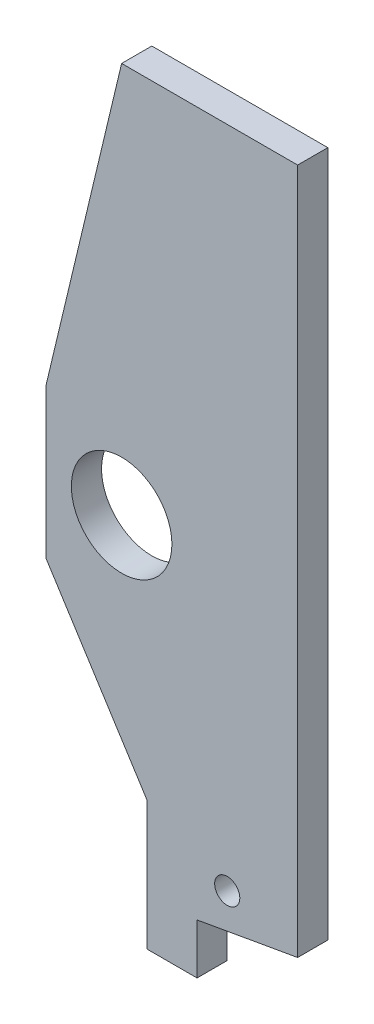
ISO-10303-21;
HEADER;
FILE_DESCRIPTION(('STEP AP214'),'2;1');
FILE_NAME('part.step','',(''),(''),'','','');
FILE_SCHEMA(('AUTOMOTIVE_DESIGN { 1 0 10303 214 1 1 1 1 }'));
ENDSEC;
DATA;
#1=APPLICATION_CONTEXT('core data for automotive mechanical design processes');
#2=APPLICATION_PROTOCOL_DEFINITION('international standard','automotive_design',2000,#1);
#3=PRODUCT_CONTEXT('',#1,'mechanical');
#4=PRODUCT('Part','Part','',(#3));
#5=PRODUCT_RELATED_PRODUCT_CATEGORY('part','',(#4));
#6=PRODUCT_DEFINITION_FORMATION('','',#4);
#7=PRODUCT_DEFINITION_CONTEXT('part definition',#1,'design');
#8=PRODUCT_DEFINITION('design','',#6,#7);
#9=PRODUCT_DEFINITION_SHAPE('','',#8);
#10=(LENGTH_UNIT() NAMED_UNIT(*) SI_UNIT(.MILLI.,.METRE.));
#11=(NAMED_UNIT(*) PLANE_ANGLE_UNIT() SI_UNIT($,.RADIAN.));
#12=(NAMED_UNIT(*) SI_UNIT($,.STERADIAN.) SOLID_ANGLE_UNIT());
#13=UNCERTAINTY_MEASURE_WITH_UNIT(LENGTH_MEASURE(1.E-05),#10,'distance_accuracy_value','');
#14=(GEOMETRIC_REPRESENTATION_CONTEXT(3) GLOBAL_UNCERTAINTY_ASSIGNED_CONTEXT((#13)) GLOBAL_UNIT_ASSIGNED_CONTEXT((#10,
#11,#12)) REPRESENTATION_CONTEXT('',''));
#15=CARTESIAN_POINT('',(0.,0.,0.));
#16=DIRECTION('',(0.,0.,1.));
#17=DIRECTION('',(1.,0.,0.));
#18=AXIS2_PLACEMENT_3D('',#15,#16,#17);
#19=CARTESIAN_POINT('',(-25.315931780366,-34.9461314475873,3.));
#20=DIRECTION('',(-1.,0.,0.));
#21=DIRECTION('',(0.,0.,1.));
#22=AXIS2_PLACEMENT_3D('',#19,#20,#21);
#23=PLANE('',#22);
#24=DIRECTION('',(0.,1.,0.));
#25=VECTOR('',#24,1.);
#26=CARTESIAN_POINT('',(-25.315931780366,-34.9461314475873,3.));
#27=LINE('',#26,#25);
#28=CARTESIAN_POINT('',(-25.315931780366,-33.1823790005765,3.));
#29=VERTEX_POINT('',#28);
#30=CARTESIAN_POINT('',(-25.315931780366,35.0538685524127,3.));
#31=VERTEX_POINT('',#30);
#32=EDGE_CURVE('E51',#29,#31,#27,.T.);
#33=ORIENTED_EDGE('',*,*,#32,.F.);
#34=DIRECTION('',(0.,0.,1.));
#35=VECTOR('',#34,1.);
#36=CARTESIAN_POINT('',(-25.315931780366,-33.1823790005765,-5.00000000001367E-05));
#37=LINE('',#36,#35);
#38=CARTESIAN_POINT('',(-25.315931780366,-33.1823790005765,0.));
#39=VERTEX_POINT('',#38);
#40=EDGE_CURVE('E102',#39,#29,#37,.T.);
#41=ORIENTED_EDGE('',*,*,#40,.F.);
#42=DIRECTION('',(0.,1.,0.));
#43=VECTOR('',#42,1.);
#44=CARTESIAN_POINT('',(-25.315931780366,-34.9461314475873,0.));
#45=LINE('',#44,#43);
#46=CARTESIAN_POINT('',(-25.315931780366,35.0538685524127,0.));
#47=VERTEX_POINT('',#46);
#48=EDGE_CURVE('E121',#39,#47,#45,.T.);
#49=ORIENTED_EDGE('',*,*,#48,.T.);
#50=DIRECTION('',(0.,0.,-1.));
#51=VECTOR('',#50,1.);
#52=CARTESIAN_POINT('',(-25.315931780366,35.0538685524127,3.));
#53=LINE('',#52,#51);
#54=EDGE_CURVE('E44',#31,#47,#53,.T.);
#55=ORIENTED_EDGE('',*,*,#54,.F.);
#56=EDGE_LOOP('',(#33,#41,#49,#55));
#57=FACE_BOUND('',#56,.T.);
#58=ADVANCED_FACE('F35',(#57),#23,.F.);
#59=CARTESIAN_POINT('',(-35.315931780366,35.0538685524127,3.));
#60=DIRECTION('',(0.,-1.,0.));
#61=DIRECTION('',(0.,0.,-1.));
#62=AXIS2_PLACEMENT_3D('',#59,#60,#61);
#63=PLANE('',#62);
#64=DIRECTION('',(-1.,0.,0.));
#65=VECTOR('',#64,1.);
#66=CARTESIAN_POINT('',(-35.315931780366,35.0538685524127,0.));
#67=LINE('',#66,#65);
#68=CARTESIAN_POINT('',(-42.815931780366,35.0538685524127,0.));
#69=VERTEX_POINT('',#68);
#70=EDGE_CURVE('E118',#47,#69,#67,.T.);
#71=ORIENTED_EDGE('',*,*,#70,.T.);
#72=DIRECTION('',(0.,0.,1.));
#73=VECTOR('',#72,1.);
#74=CARTESIAN_POINT('',(-42.815931780366,35.0538685524127,0.));
#75=LINE('',#74,#73);
#76=CARTESIAN_POINT('',(-42.815931780366,35.0538685524127,3.));
#77=VERTEX_POINT('',#76);
#78=EDGE_CURVE('E183',#69,#77,#75,.T.);
#79=ORIENTED_EDGE('',*,*,#78,.T.);
#80=DIRECTION('',(-1.,0.,0.));
#81=VECTOR('',#80,1.);
#82=CARTESIAN_POINT('',(-35.315931780366,35.0538685524127,3.));
#83=LINE('',#82,#81);
#84=EDGE_CURVE('E117',#31,#77,#83,.T.);
#85=ORIENTED_EDGE('',*,*,#84,.F.);
#86=ORIENTED_EDGE('',*,*,#54,.T.);
#87=EDGE_LOOP('',(#71,#79,#85,#86));
#88=FACE_BOUND('',#87,.T.);
#89=ADVANCED_FACE('F226',(#88),#63,.F.);
#90=CARTESIAN_POINT('',(0.,0.,3.));
#91=DIRECTION('',(0.,0.,-1.));
#92=DIRECTION('',(-1.,0.,0.));
#93=AXIS2_PLACEMENT_3D('',#90,#91,#92);
#94=PLANE('',#93);
#95=CARTESIAN_POINT('',(-32.315931780366,-30.9461314475873,3.));
#96=DIRECTION('',(0.,0.,1.));
#97=DIRECTION('',(1.,0.,0.));
#98=AXIS2_PLACEMENT_3D('',#95,#96,#97);
#99=CIRCLE('',#98,1.25);
#100=CARTESIAN_POINT('',(-31.065931780366,-30.9461314475873,3.));
#101=VERTEX_POINT('',#100);
#102=EDGE_CURVE('E140',#101,#101,#99,.T.);
#103=ORIENTED_EDGE('',*,*,#102,.F.);
#104=EDGE_LOOP('',(#103));
#105=FACE_BOUND('',#104,.T.);
#106=CARTESIAN_POINT('',(-42.815931780366,-3.84613144758735,3.));
#107=DIRECTION('',(0.,0.,1.));
#108=DIRECTION('',(1.,0.,0.));
#109=AXIS2_PLACEMENT_3D('',#106,#107,#108);
#110=CIRCLE('',#109,5.);
#111=CARTESIAN_POINT('',(-37.815931780366,-3.84613144758735,3.));
#112=VERTEX_POINT('',#111);
#113=EDGE_CURVE('E137',#112,#112,#110,.T.);
#114=ORIENTED_EDGE('',*,*,#113,.F.);
#115=EDGE_LOOP('',(#114));
#116=FACE_BOUND('',#115,.T.);
#117=DIRECTION('',(0.,-1.,0.));
#118=VECTOR('',#117,1.);
#119=CARTESIAN_POINT('',(-35.3159317803662,-1.47032102244952E-13,3.));
#120=LINE('',#119,#118);
#121=CARTESIAN_POINT('',(-35.315931780366,-34.9461314475873,3.));
#122=VERTEX_POINT('',#121);
#123=CARTESIAN_POINT('',(-35.315931780366,-39.9461314475873,3.));
#124=VERTEX_POINT('',#123);
#125=EDGE_CURVE('E114',#122,#124,#120,.T.);
#126=ORIENTED_EDGE('',*,*,#125,.F.);
#127=DIRECTION('',(-0.984799623762772,-0.173694274622694,0.));
#128=VECTOR('',#127,1.);
#129=CARTESIAN_POINT('',(-35.315931780366,-34.9461314475873,3.));
#130=LINE('',#129,#128);
#131=EDGE_CURVE('E104',#29,#122,#130,.T.);
#132=ORIENTED_EDGE('',*,*,#131,.F.);
#133=ORIENTED_EDGE('',*,*,#32,.T.);
#134=ORIENTED_EDGE('',*,*,#84,.T.);
#135=DIRECTION('',(-0.232318420027201,-0.972639785180549,0.));
#136=VECTOR('',#135,1.);
#137=CARTESIAN_POINT('',(-48.4259238946689,11.566701567198,3.));
#138=LINE('',#137,#136);
#139=CARTESIAN_POINT('',(-50.315931780366,3.65386855241265,3.));
#140=VERTEX_POINT('',#139);
#141=EDGE_CURVE('E175',#77,#140,#138,.T.);
#142=ORIENTED_EDGE('',*,*,#141,.T.);
#143=DIRECTION('',(0.,-1.,0.));
#144=VECTOR('',#143,1.);
#145=CARTESIAN_POINT('',(-50.315931780366,0.,3.));
#146=LINE('',#145,#144);
#147=CARTESIAN_POINT('',(-50.315931780366,-11.3461314475873,3.));
#148=VERTEX_POINT('',#147);
#149=EDGE_CURVE('E192',#140,#148,#146,.T.);
#150=ORIENTED_EDGE('',*,*,#149,.T.);
#151=DIRECTION('',(0.536412624057495,-0.84395586185046,0.));
#152=VECTOR('',#151,1.);
#153=CARTESIAN_POINT('',(-40.9745919188176,-26.0431728297569,3.));
#154=LINE('',#153,#152);
#155=CARTESIAN_POINT('',(-40.315931780366,-27.0794647809207,3.));
#156=VERTEX_POINT('',#155);
#157=EDGE_CURVE('E156',#148,#156,#154,.T.);
#158=ORIENTED_EDGE('',*,*,#157,.T.);
#159=DIRECTION('',(0.,1.,0.));
#160=VECTOR('',#159,1.);
#161=CARTESIAN_POINT('',(-40.315931780366,0.,3.));
#162=LINE('',#161,#160);
#163=CARTESIAN_POINT('',(-40.315931780366,-39.9461314475873,3.));
#164=VERTEX_POINT('',#163);
#165=EDGE_CURVE('E136',#164,#156,#162,.T.);
#166=ORIENTED_EDGE('',*,*,#165,.F.);
#167=DIRECTION('',(-1.,0.,0.));
#168=VECTOR('',#167,1.);
#169=CARTESIAN_POINT('',(0.,-39.9461314475873,3.));
#170=LINE('',#169,#168);
#171=EDGE_CURVE('E171',#124,#164,#170,.T.);
#172=ORIENTED_EDGE('',*,*,#171,.F.);
#173=EDGE_LOOP('',(#126,#132,#133,#134,#142,#150,#158,#166,#172));
#174=FACE_BOUND('',#173,.T.);
#175=ADVANCED_FACE('F112',(#105,#116,#174),#94,.F.);
#176=CARTESIAN_POINT('',(0.,0.,0.));
#177=DIRECTION('',(0.,0.,-1.));
#178=DIRECTION('',(-1.,0.,0.));
#179=AXIS2_PLACEMENT_3D('',#176,#177,#178);
#180=PLANE('',#179);
#181=DIRECTION('',(0.984799623762771,0.173694274622694,0.));
#182=VECTOR('',#181,1.);
#183=CARTESIAN_POINT('',(4.91220643239281,-27.850883726443,0.));
#184=LINE('',#183,#182);
#185=CARTESIAN_POINT('',(-35.315931780366,-34.9461314475873,-2.25000000000684E-05));
#186=VERTEX_POINT('',#185);
#187=EDGE_CURVE('E107',#186,#39,#184,.T.);
#188=ORIENTED_EDGE('',*,*,#187,.F.);
#189=DIRECTION('',(0.,-1.,0.));
#190=VECTOR('',#189,1.);
#191=CARTESIAN_POINT('',(-35.3159317803662,-1.47032102244952E-13,0.));
#192=LINE('',#191,#190);
#193=CARTESIAN_POINT('',(-35.315931780366,-39.9461314475873,0.));
#194=VERTEX_POINT('',#193);
#195=EDGE_CURVE('E124',#186,#194,#192,.T.);
#196=ORIENTED_EDGE('',*,*,#195,.T.);
#197=DIRECTION('',(-1.,0.,0.));
#198=VECTOR('',#197,1.);
#199=CARTESIAN_POINT('',(0.,-39.9461314475873,0.));
#200=LINE('',#199,#198);
#201=CARTESIAN_POINT('',(-40.315931780366,-39.9461314475873,0.));
#202=VERTEX_POINT('',#201);
#203=EDGE_CURVE('E155',#194,#202,#200,.T.);
#204=ORIENTED_EDGE('',*,*,#203,.T.);
#205=DIRECTION('',(0.,1.,0.));
#206=VECTOR('',#205,1.);
#207=CARTESIAN_POINT('',(-40.315931780366,0.,0.));
#208=LINE('',#207,#206);
#209=CARTESIAN_POINT('',(-40.315931780366,-27.0794647809207,0.));
#210=VERTEX_POINT('',#209);
#211=EDGE_CURVE('E153',#202,#210,#208,.T.);
#212=ORIENTED_EDGE('',*,*,#211,.T.);
#213=DIRECTION('',(0.536412624057495,-0.84395586185046,0.));
#214=VECTOR('',#213,1.);
#215=CARTESIAN_POINT('',(-40.9745919188176,-26.0431728297569,0.));
#216=LINE('',#215,#214);
#217=CARTESIAN_POINT('',(-50.315931780366,-11.3461314475873,0.));
#218=VERTEX_POINT('',#217);
#219=EDGE_CURVE('E165',#218,#210,#216,.T.);
#220=ORIENTED_EDGE('',*,*,#219,.F.);
#221=DIRECTION('',(0.,-1.,0.));
#222=VECTOR('',#221,1.);
#223=CARTESIAN_POINT('',(-50.315931780366,0.,0.));
#224=LINE('',#223,#222);
#225=CARTESIAN_POINT('',(-50.315931780366,3.65386855241265,0.));
#226=VERTEX_POINT('',#225);
#227=EDGE_CURVE('E162',#226,#218,#224,.T.);
#228=ORIENTED_EDGE('',*,*,#227,.F.);
#229=DIRECTION('',(-0.232318420027201,-0.972639785180549,0.));
#230=VECTOR('',#229,1.);
#231=CARTESIAN_POINT('',(-48.4259238946689,11.566701567198,0.));
#232=LINE('',#231,#230);
#233=EDGE_CURVE('E159',#69,#226,#232,.T.);
#234=ORIENTED_EDGE('',*,*,#233,.F.);
#235=ORIENTED_EDGE('',*,*,#70,.F.);
#236=ORIENTED_EDGE('',*,*,#48,.F.);
#237=EDGE_LOOP('',(#188,#196,#204,#212,#220,#228,#234,#235,#236));
#238=FACE_BOUND('',#237,.T.);
#239=CARTESIAN_POINT('',(-32.315931780366,-30.9461314475873,0.));
#240=DIRECTION('',(0.,0.,-1.));
#241=DIRECTION('',(-1.,0.,0.));
#242=AXIS2_PLACEMENT_3D('',#239,#240,#241);
#243=CIRCLE('',#242,1.25);
#244=CARTESIAN_POINT('',(-33.565931780366,-30.9461314475873,0.));
#245=VERTEX_POINT('',#244);
#246=EDGE_CURVE('E138',#245,#245,#243,.T.);
#247=ORIENTED_EDGE('',*,*,#246,.F.);
#248=EDGE_LOOP('',(#247));
#249=FACE_BOUND('',#248,.T.);
#250=CARTESIAN_POINT('',(-42.815931780366,-3.84613144758735,0.));
#251=DIRECTION('',(0.,0.,-1.));
#252=DIRECTION('',(-1.,0.,0.));
#253=AXIS2_PLACEMENT_3D('',#250,#251,#252);
#254=CIRCLE('',#253,5.);
#255=CARTESIAN_POINT('',(-47.815931780366,-3.84613144758735,0.));
#256=VERTEX_POINT('',#255);
#257=EDGE_CURVE('E133',#256,#256,#254,.T.);
#258=ORIENTED_EDGE('',*,*,#257,.F.);
#259=EDGE_LOOP('',(#258));
#260=FACE_BOUND('',#259,.T.);
#261=ADVANCED_FACE('F222',(#238,#249,#260),#180,.T.);
#262=CARTESIAN_POINT('',(-40.315931780366,0.,0.));
#263=DIRECTION('',(1.,0.,0.));
#264=DIRECTION('',(0.,1.,0.));
#265=AXIS2_PLACEMENT_3D('',#262,#263,#264);
#266=PLANE('',#265);
#267=ORIENTED_EDGE('',*,*,#165,.T.);
#268=DIRECTION('',(0.,0.,1.));
#269=VECTOR('',#268,1.);
#270=CARTESIAN_POINT('',(-40.315931780366,-27.0794647809207,0.));
#271=LINE('',#270,#269);
#272=EDGE_CURVE('E128',#210,#156,#271,.T.);
#273=ORIENTED_EDGE('',*,*,#272,.F.);
#274=ORIENTED_EDGE('',*,*,#211,.F.);
#275=DIRECTION('',(0.,0.,1.));
#276=VECTOR('',#275,1.);
#277=CARTESIAN_POINT('',(-40.315931780366,-39.9461314475873,0.));
#278=LINE('',#277,#276);
#279=EDGE_CURVE('E168',#202,#164,#278,.T.);
#280=ORIENTED_EDGE('',*,*,#279,.T.);
#281=EDGE_LOOP('',(#267,#273,#274,#280));
#282=FACE_BOUND('',#281,.T.);
#283=ADVANCED_FACE('F211',(#282),#266,.F.);
#284=CARTESIAN_POINT('',(-40.9745919188176,-26.0431728297569,0.));
#285=DIRECTION('',(-0.84395586185046,-0.536412624057495,0.));
#286=DIRECTION('',(0.536412624057495,-0.84395586185046,0.));
#287=AXIS2_PLACEMENT_3D('',#284,#285,#286);
#288=PLANE('',#287);
#289=ORIENTED_EDGE('',*,*,#157,.F.);
#290=DIRECTION('',(0.,0.,1.));
#291=VECTOR('',#290,1.);
#292=CARTESIAN_POINT('',(-50.315931780366,-11.3461314475873,0.));
#293=LINE('',#292,#291);
#294=EDGE_CURVE('E188',#218,#148,#293,.T.);
#295=ORIENTED_EDGE('',*,*,#294,.F.);
#296=ORIENTED_EDGE('',*,*,#219,.T.);
#297=ORIENTED_EDGE('',*,*,#272,.T.);
#298=EDGE_LOOP('',(#289,#295,#296,#297));
#299=FACE_BOUND('',#298,.T.);
#300=ADVANCED_FACE('F207',(#299),#288,.T.);
#301=CARTESIAN_POINT('',(-50.315931780366,0.,0.));
#302=DIRECTION('',(-1.,0.,0.));
#303=DIRECTION('',(0.,0.,1.));
#304=AXIS2_PLACEMENT_3D('',#301,#302,#303);
#305=PLANE('',#304);
#306=ORIENTED_EDGE('',*,*,#149,.F.);
#307=DIRECTION('',(0.,0.,1.));
#308=VECTOR('',#307,1.);
#309=CARTESIAN_POINT('',(-50.315931780366,3.65386855241265,0.));
#310=LINE('',#309,#308);
#311=EDGE_CURVE('E186',#226,#140,#310,.T.);
#312=ORIENTED_EDGE('',*,*,#311,.F.);
#313=ORIENTED_EDGE('',*,*,#227,.T.);
#314=ORIENTED_EDGE('',*,*,#294,.T.);
#315=EDGE_LOOP('',(#306,#312,#313,#314));
#316=FACE_BOUND('',#315,.T.);
#317=ADVANCED_FACE('F204',(#316),#305,.T.);
#318=CARTESIAN_POINT('',(-48.4259238946689,11.566701567198,0.));
#319=DIRECTION('',(-0.972639785180549,0.232318420027201,0.));
#320=DIRECTION('',(-0.232318420027201,-0.972639785180549,0.));
#321=AXIS2_PLACEMENT_3D('',#318,#319,#320);
#322=PLANE('',#321);
#323=ORIENTED_EDGE('',*,*,#141,.F.);
#324=ORIENTED_EDGE('',*,*,#78,.F.);
#325=ORIENTED_EDGE('',*,*,#233,.T.);
#326=ORIENTED_EDGE('',*,*,#311,.T.);
#327=EDGE_LOOP('',(#323,#324,#325,#326));
#328=FACE_BOUND('',#327,.T.);
#329=ADVANCED_FACE('F200',(#328),#322,.T.);
#330=CARTESIAN_POINT('',(-35.3159317803662,-1.47032102244952E-13,0.));
#331=DIRECTION('',(-1.,0.,0.));
#332=DIRECTION('',(0.,-1.,0.));
#333=AXIS2_PLACEMENT_3D('',#330,#331,#332);
#334=PLANE('',#333);
#335=DIRECTION('',(0.,0.,-1.));
#336=VECTOR('',#335,1.);
#337=CARTESIAN_POINT('',(-35.315931780366,-34.9461314475873,3.));
#338=LINE('',#337,#336);
#339=EDGE_CURVE('E11',#122,#186,#338,.T.);
#340=ORIENTED_EDGE('',*,*,#339,.F.);
#341=ORIENTED_EDGE('',*,*,#125,.T.);
#342=DIRECTION('',(0.,0.,1.));
#343=VECTOR('',#342,1.);
#344=CARTESIAN_POINT('',(-35.315931780366,-39.9461314475873,0.));
#345=LINE('',#344,#343);
#346=EDGE_CURVE('E180',#194,#124,#345,.T.);
#347=ORIENTED_EDGE('',*,*,#346,.F.);
#348=ORIENTED_EDGE('',*,*,#195,.F.);
#349=EDGE_LOOP('',(#340,#341,#347,#348));
#350=FACE_BOUND('',#349,.T.);
#351=ADVANCED_FACE('F220',(#350),#334,.F.);
#352=CARTESIAN_POINT('',(0.,-39.9461314475873,0.));
#353=DIRECTION('',(0.,1.,0.));
#354=DIRECTION('',(0.,0.,1.));
#355=AXIS2_PLACEMENT_3D('',#352,#353,#354);
#356=PLANE('',#355);
#357=ORIENTED_EDGE('',*,*,#171,.T.);
#358=ORIENTED_EDGE('',*,*,#279,.F.);
#359=ORIENTED_EDGE('',*,*,#203,.F.);
#360=ORIENTED_EDGE('',*,*,#346,.T.);
#361=EDGE_LOOP('',(#357,#358,#359,#360));
#362=FACE_BOUND('',#361,.T.);
#363=ADVANCED_FACE('F216',(#362),#356,.F.);
#364=CARTESIAN_POINT('',(-42.815931780366,-3.84613144758735,-5.00000000001367E-05));
#365=DIRECTION('',(0.,0.,1.));
#366=DIRECTION('',(1.,0.,0.));
#367=AXIS2_PLACEMENT_3D('',#364,#365,#366);
#368=CYLINDRICAL_SURFACE('',#367,5.);
#369=ORIENTED_EDGE('',*,*,#257,.T.);
#370=EDGE_LOOP('',(#369));
#371=FACE_BOUND('',#370,.T.);
#372=ORIENTED_EDGE('',*,*,#113,.T.);
#373=EDGE_LOOP('',(#372));
#374=FACE_BOUND('',#373,.T.);
#375=ADVANCED_FACE('F241',(#371,#374),#368,.F.);
#376=CARTESIAN_POINT('',(-32.315931780366,-30.9461314475873,-5.00000000001367E-05));
#377=DIRECTION('',(0.,0.,1.));
#378=DIRECTION('',(1.,0.,0.));
#379=AXIS2_PLACEMENT_3D('',#376,#377,#378);
#380=CYLINDRICAL_SURFACE('',#379,1.25);
#381=ORIENTED_EDGE('',*,*,#246,.T.);
#382=EDGE_LOOP('',(#381));
#383=FACE_BOUND('',#382,.T.);
#384=ORIENTED_EDGE('',*,*,#102,.T.);
#385=EDGE_LOOP('',(#384));
#386=FACE_BOUND('',#385,.T.);
#387=ADVANCED_FACE('F252',(#383,#386),#380,.F.);
#388=CARTESIAN_POINT('',(-35.315931780366,-34.9461314475873,-5.00000000001367E-05));
#389=DIRECTION('',(-0.173694274622694,0.984799623762771,0.));
#390=DIRECTION('',(-0.984799623762771,-0.173694274622694,0.));
#391=AXIS2_PLACEMENT_3D('',#388,#389,#390);
#392=PLANE('',#391);
#393=ORIENTED_EDGE('',*,*,#187,.T.);
#394=ORIENTED_EDGE('',*,*,#40,.T.);
#395=ORIENTED_EDGE('',*,*,#131,.T.);
#396=ORIENTED_EDGE('',*,*,#339,.T.);
#397=EDGE_LOOP('',(#393,#394,#395,#396));
#398=FACE_BOUND('',#397,.T.);
#399=ADVANCED_FACE('F103',(#398),#392,.F.);
#400=CLOSED_SHELL('',(#58,#89,#175,#261,#283,#300,#317,#329,#351,#363,#375,#387,#399));
#401=MANIFOLD_SOLID_BREP('B2',#400);
#402=ADVANCED_BREP_SHAPE_REPRESENTATION('',(#18,#401),#14);
#403=SHAPE_DEFINITION_REPRESENTATION(#9,#402);
ENDSEC;
END-ISO-10303-21;
